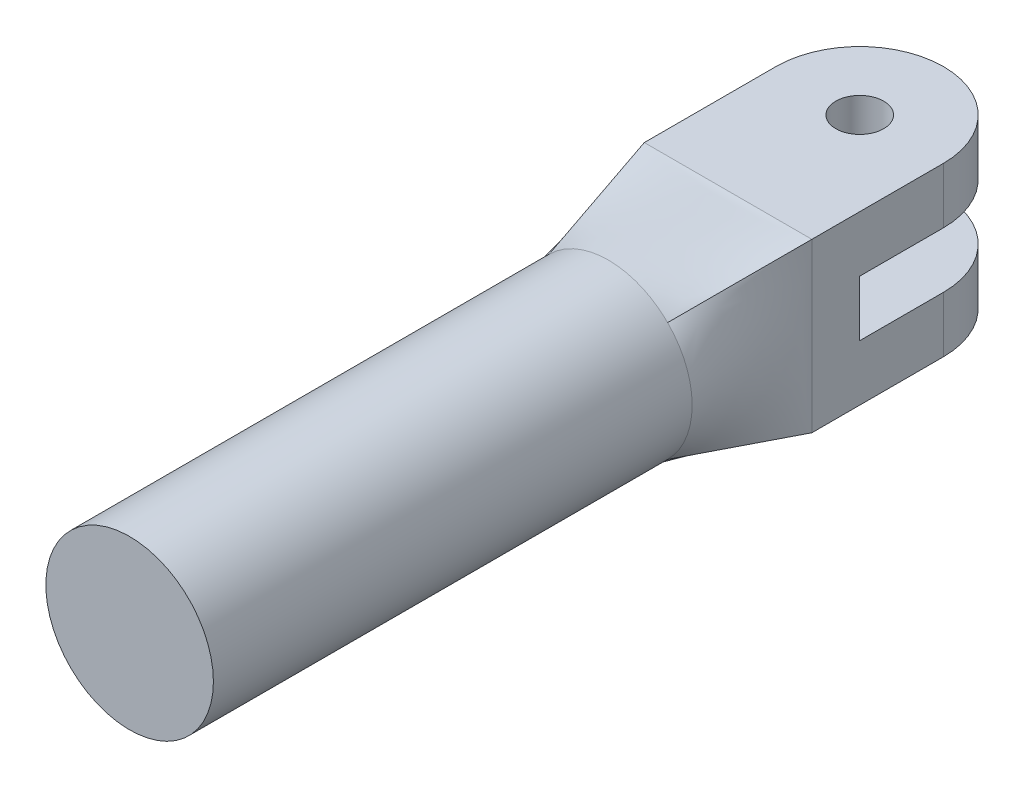
ISO-10303-21;
HEADER;
FILE_DESCRIPTION(('STEP AP214'),'2;1');
FILE_NAME('part.step','',(''),(''),'','','');
FILE_SCHEMA(('AUTOMOTIVE_DESIGN { 1 0 10303 214 1 1 1 1 }'));
ENDSEC;
DATA;
#1=APPLICATION_CONTEXT('core data for automotive mechanical design processes');
#2=APPLICATION_PROTOCOL_DEFINITION('international standard','automotive_design',2000,#1);
#3=PRODUCT_CONTEXT('',#1,'mechanical');
#4=PRODUCT('Part','Part','',(#3));
#5=PRODUCT_RELATED_PRODUCT_CATEGORY('part','',(#4));
#6=PRODUCT_DEFINITION_FORMATION('','',#4);
#7=PRODUCT_DEFINITION_CONTEXT('part definition',#1,'design');
#8=PRODUCT_DEFINITION('design','',#6,#7);
#9=PRODUCT_DEFINITION_SHAPE('','',#8);
#10=(LENGTH_UNIT() NAMED_UNIT(*) SI_UNIT(.MILLI.,.METRE.));
#11=(NAMED_UNIT(*) PLANE_ANGLE_UNIT() SI_UNIT($,.RADIAN.));
#12=(NAMED_UNIT(*) SI_UNIT($,.STERADIAN.) SOLID_ANGLE_UNIT());
#13=UNCERTAINTY_MEASURE_WITH_UNIT(LENGTH_MEASURE(1.E-05),#10,'distance_accuracy_value','');
#14=(GEOMETRIC_REPRESENTATION_CONTEXT(3) GLOBAL_UNCERTAINTY_ASSIGNED_CONTEXT((#13)) GLOBAL_UNIT_ASSIGNED_CONTEXT((#10,
#11,#12)) REPRESENTATION_CONTEXT('',''));
#15=CARTESIAN_POINT('',(0.,0.,0.));
#16=DIRECTION('',(0.,0.,1.));
#17=DIRECTION('',(1.,0.,0.));
#18=AXIS2_PLACEMENT_3D('',#15,#16,#17);
#19=CARTESIAN_POINT('',(0.,0.,-27.));
#20=DIRECTION('',(0.,0.,1.));
#21=DIRECTION('',(1.,0.,0.));
#22=AXIS2_PLACEMENT_3D('',#19,#20,#21);
#23=PLANE('',#22);
#24=DIRECTION('',(1.,0.,0.));
#25=VECTOR('',#24,1.);
#26=CARTESIAN_POINT('',(3.5,-1.16666666666667,-27.));
#27=LINE('',#26,#25);
#28=CARTESIAN_POINT('',(-3.5,-1.16666666666667,-27.));
#29=VERTEX_POINT('',#28);
#30=CARTESIAN_POINT('',(3.5,-1.16666666666667,-27.));
#31=VERTEX_POINT('',#30);
#32=EDGE_CURVE('E185',#29,#31,#27,.T.);
#33=ORIENTED_EDGE('',*,*,#32,.F.);
#34=DIRECTION('',(0.,1.,0.));
#35=VECTOR('',#34,1.);
#36=CARTESIAN_POINT('',(-3.5,-3.5,-27.));
#37=LINE('',#36,#35);
#38=CARTESIAN_POINT('',(-3.5,1.16666666666667,-27.));
#39=VERTEX_POINT('',#38);
#40=EDGE_CURVE('E170',#29,#39,#37,.T.);
#41=ORIENTED_EDGE('',*,*,#40,.T.);
#42=DIRECTION('',(-1.,0.,0.));
#43=VECTOR('',#42,1.);
#44=CARTESIAN_POINT('',(3.5,1.16666666666667,-27.));
#45=LINE('',#44,#43);
#46=CARTESIAN_POINT('',(3.5,1.16666666666667,-27.));
#47=VERTEX_POINT('',#46);
#48=EDGE_CURVE('E177',#47,#39,#45,.T.);
#49=ORIENTED_EDGE('',*,*,#48,.F.);
#50=DIRECTION('',(0.,-1.,0.));
#51=VECTOR('',#50,1.);
#52=CARTESIAN_POINT('',(3.5,-3.5,-27.));
#53=LINE('',#52,#51);
#54=EDGE_CURVE('E187',#47,#31,#53,.T.);
#55=ORIENTED_EDGE('',*,*,#54,.T.);
#56=EDGE_LOOP('',(#33,#41,#49,#55));
#57=FACE_BOUND('',#56,.T.);
#58=ADVANCED_FACE('F75',(#57),#23,.F.);
#59=CARTESIAN_POINT('',(0.,0.,-20.));
#60=DIRECTION('',(0.,0.,1.));
#61=DIRECTION('',(1.,0.,0.));
#62=AXIS2_PLACEMENT_3D('',#59,#60,#61);
#63=CYLINDRICAL_SURFACE('',#62,3.5);
#64=CARTESIAN_POINT('',(-2.47487373415292,2.47487373415292,-20.));
#65=CARTESIAN_POINT('',(-2.18320706748625,2.76654040081958,-20.));
#66=CARTESIAN_POINT('',(-1.81537804850474,3.0280550867366,-20.));
#67=CARTESIAN_POINT('',(-0.96486338398876,3.3961380592582,-20.));
#68=CARTESIAN_POINT('',(-0.483249156101944,3.5,-20.));
#69=CARTESIAN_POINT('',(0.483249156101944,3.5,-20.));
#70=CARTESIAN_POINT('',(0.964863383988761,3.3961380592582,-20.));
#71=CARTESIAN_POINT('',(1.81537804850474,3.0280550867366,-20.));
#72=CARTESIAN_POINT('',(2.18320706748625,2.76654040081958,-20.));
#73=CARTESIAN_POINT('',(2.47487373415292,2.47487373415292,-20.));
#74=B_SPLINE_CURVE_WITH_KNOTS('',3,(#64,#65,#66,#67,#68,#69,#70,#71,#72,#73),.UNSPECIFIED.,.F.,
.F.,(4,2,2,2,4),(0.,0.25,0.5,0.75,1.),.UNSPECIFIED.);
#75=CARTESIAN_POINT('',(2.47487373415292,2.47487373415292,-20.));
#76=VERTEX_POINT('',#75);
#77=CARTESIAN_POINT('',(-2.47487373415292,2.47487373415292,-20.));
#78=VERTEX_POINT('',#77);
#79=EDGE_CURVE('E286',#76,#78,#74,.F.);
#80=ORIENTED_EDGE('',*,*,#79,.T.);
#81=CARTESIAN_POINT('',(0.,0.,-20.));
#82=DIRECTION('',(0.,0.,-1.));
#83=DIRECTION('',(1.,0.,0.));
#84=AXIS2_PLACEMENT_3D('',#81,#82,#83);
#85=CIRCLE('',#84,3.5);
#86=CARTESIAN_POINT('',(-2.47487373415292,-2.47487373415292,-20.));
#87=VERTEX_POINT('',#86);
#88=EDGE_CURVE('E269',#87,#78,#85,.T.);
#89=ORIENTED_EDGE('',*,*,#88,.F.);
#90=CARTESIAN_POINT('',(0.,0.,-20.));
#91=DIRECTION('',(0.,0.,-1.));
#92=DIRECTION('',(1.,0.,0.));
#93=AXIS2_PLACEMENT_3D('',#90,#91,#92);
#94=CIRCLE('',#93,3.5);
#95=CARTESIAN_POINT('',(2.47487373415292,-2.47487373415292,-20.));
#96=VERTEX_POINT('',#95);
#97=EDGE_CURVE('E261',#96,#87,#94,.T.);
#98=ORIENTED_EDGE('',*,*,#97,.F.);
#99=CARTESIAN_POINT('',(0.,0.,-20.));
#100=DIRECTION('',(0.,0.,1.));
#101=DIRECTION('',(1.,0.,0.));
#102=AXIS2_PLACEMENT_3D('',#99,#100,#101);
#103=CIRCLE('',#102,3.5);
#104=EDGE_CURVE('E266',#76,#96,#103,.F.);
#105=ORIENTED_EDGE('',*,*,#104,.F.);
#106=EDGE_LOOP('',(#80,#89,#98,#105));
#107=FACE_BOUND('',#106,.T.);
#108=CARTESIAN_POINT('',(0.,0.,0.));
#109=DIRECTION('',(0.,0.,1.));
#110=DIRECTION('',(1.,0.,0.));
#111=AXIS2_PLACEMENT_3D('',#108,#109,#110);
#112=CIRCLE('',#111,3.5);
#113=CARTESIAN_POINT('',(3.5,0.,0.));
#114=VERTEX_POINT('',#113);
#115=EDGE_CURVE('E305',#114,#114,#112,.T.);
#116=ORIENTED_EDGE('',*,*,#115,.F.);
#117=EDGE_LOOP('',(#116));
#118=FACE_BOUND('',#117,.T.);
#119=ADVANCED_FACE('F316',(#107,#118),#63,.T.);
#120=CARTESIAN_POINT('',(0.,0.,0.));
#121=DIRECTION('',(0.,0.,1.));
#122=DIRECTION('',(1.,0.,0.));
#123=AXIS2_PLACEMENT_3D('',#120,#121,#122);
#124=PLANE('',#123);
#125=ORIENTED_EDGE('',*,*,#115,.T.);
#126=EDGE_LOOP('',(#125));
#127=FACE_BOUND('',#126,.T.);
#128=ADVANCED_FACE('F337',(#127),#124,.T.);
#129=CARTESIAN_POINT('',(-3.5,3.5,-25.));
#130=CARTESIAN_POINT('',(-2.47487373415292,2.47487373415292,-20.));
#131=CARTESIAN_POINT('',(-3.5,2.91666666666667,-25.));
#132=CARTESIAN_POINT('',(-2.76654040081958,2.18320706748625,-20.));
#133=CARTESIAN_POINT('',(-3.5,2.33333333333333,-25.));
#134=CARTESIAN_POINT('',(-3.0280550867366,1.81537804850474,-20.));
#135=CARTESIAN_POINT('',(-3.5,1.16666666666666,-25.));
#136=CARTESIAN_POINT('',(-3.39613805925819,0.964863383988761,-20.));
#137=CARTESIAN_POINT('',(-3.5,0.583333333333331,-25.));
#138=CARTESIAN_POINT('',(-3.5,0.483249156101944,-20.));
#139=CARTESIAN_POINT('',(-3.5,-0.583333333333335,-25.));
#140=CARTESIAN_POINT('',(-3.5,-0.483249156101943,-20.));
#141=CARTESIAN_POINT('',(-3.5,-1.16666666666667,-25.));
#142=CARTESIAN_POINT('',(-3.3961380592582,-0.96486338398876,-20.));
#143=CARTESIAN_POINT('',(-3.5,-2.33333333333333,-25.));
#144=CARTESIAN_POINT('',(-3.0280550867366,-1.81537804850474,-20.));
#145=CARTESIAN_POINT('',(-3.5,-2.91666666666667,-25.));
#146=CARTESIAN_POINT('',(-2.76654040081958,-2.18320706748625,-20.));
#147=CARTESIAN_POINT('',(-3.5,-3.5,-25.));
#148=CARTESIAN_POINT('',(-2.47487373415292,-2.47487373415292,-20.));
#149=B_SPLINE_SURFACE_WITH_KNOTS('',3,1,((#129,#130),(#131,#132),(#133,#134),(#135,#136),(#137,
#138),(#139,#140),(#141,#142),(#143,#144),(#145,#146),(#147,#148)),.UNSPECIFIED.,.F.,.F.,.F.,(4,
2,2,2,4),(2,2),(0.,0.25,0.5,0.75,1.),(0.,1.),.UNSPECIFIED.);
#150=DIRECTION('',(0.,1.,0.));
#151=VECTOR('',#150,1.);
#152=CARTESIAN_POINT('',(-3.5,-3.5,-25.));
#153=LINE('',#152,#151);
#154=CARTESIAN_POINT('',(-3.5,-3.5,-25.));
#155=VERTEX_POINT('',#154);
#156=CARTESIAN_POINT('',(-3.5,3.5,-25.));
#157=VERTEX_POINT('',#156);
#158=EDGE_CURVE('E441',#155,#157,#153,.T.);
#159=DIRECTION('',(0.196914887553392,0.196914887553392,0.960442113882805));
#160=VECTOR('',#159,1.);
#161=CARTESIAN_POINT('',(-2.98743686707646,-2.98743686707646,-22.5));
#162=LINE('',#161,#160);
#163=EDGE_CURVE('E215',#155,#87,#162,.T.);
#164=DIRECTION('',(-0.196914887553392,0.196914887553392,-0.960442113882805));
#165=VECTOR('',#164,1.);
#166=CARTESIAN_POINT('',(-2.98743686707646,2.98743686707646,-22.5));
#167=LINE('',#166,#165);
#168=EDGE_CURVE('E274',#78,#157,#167,.T.);
#169=ORIENTED_EDGE('',*,*,#158,.F.);
#170=ORIENTED_EDGE('',*,*,#163,.T.);
#171=ORIENTED_EDGE('',*,*,#88,.T.);
#172=ORIENTED_EDGE('',*,*,#168,.T.);
#173=EDGE_LOOP('',(#169,#170,#171,#172));
#174=FACE_BOUND('',#173,.T.);
#175=ADVANCED_FACE('F230',(#174),#149,.T.);
#176=CARTESIAN_POINT('',(-3.5,-3.5,-25.));
#177=CARTESIAN_POINT('',(-2.47487373415292,-2.47487373415292,-20.));
#178=CARTESIAN_POINT('',(-2.91666666666667,-3.5,-25.));
#179=CARTESIAN_POINT('',(-2.18320706748625,-2.76654040081958,-20.));
#180=CARTESIAN_POINT('',(-2.33333333333333,-3.5,-25.));
#181=CARTESIAN_POINT('',(-1.81537804850474,-3.0280550867366,-20.));
#182=CARTESIAN_POINT('',(-1.16666666666666,-3.5,-25.));
#183=CARTESIAN_POINT('',(-0.964863383988761,-3.3961380592582,-20.));
#184=CARTESIAN_POINT('',(-0.583333333333331,-3.5,-25.));
#185=CARTESIAN_POINT('',(-0.483249156101945,-3.5,-20.));
#186=CARTESIAN_POINT('',(0.583333333333335,-3.5,-25.));
#187=CARTESIAN_POINT('',(0.483249156101943,-3.5,-20.));
#188=CARTESIAN_POINT('',(1.16666666666667,-3.5,-25.));
#189=CARTESIAN_POINT('',(0.96486338398876,-3.3961380592582,-20.));
#190=CARTESIAN_POINT('',(2.33333333333333,-3.5,-25.));
#191=CARTESIAN_POINT('',(1.81537804850473,-3.0280550867366,-20.));
#192=CARTESIAN_POINT('',(2.91666666666667,-3.5,-25.));
#193=CARTESIAN_POINT('',(2.18320706748625,-2.76654040081958,-20.));
#194=CARTESIAN_POINT('',(3.5,-3.5,-25.));
#195=CARTESIAN_POINT('',(2.47487373415292,-2.47487373415292,-20.));
#196=B_SPLINE_SURFACE_WITH_KNOTS('',3,1,((#176,#177),(#178,#179),(#180,#181),(#182,#183),(#184,
#185),(#186,#187),(#188,#189),(#190,#191),(#192,#193),(#194,#195)),.UNSPECIFIED.,.F.,.F.,.F.,(4,
2,2,2,4),(2,2),(0.,0.25,0.5,0.75,1.),(0.,1.),.UNSPECIFIED.);
#197=DIRECTION('',(-1.,0.,0.));
#198=VECTOR('',#197,1.);
#199=CARTESIAN_POINT('',(3.5,-3.5,-25.));
#200=LINE('',#199,#198);
#201=CARTESIAN_POINT('',(3.5,-3.5,-25.));
#202=VERTEX_POINT('',#201);
#203=EDGE_CURVE('E209',#202,#155,#200,.T.);
#204=DIRECTION('',(-0.196914887553392,0.196914887553392,0.960442113882805));
#205=VECTOR('',#204,1.);
#206=CARTESIAN_POINT('',(2.98743686707646,-2.98743686707646,-22.5));
#207=LINE('',#206,#205);
#208=EDGE_CURVE('E265',#202,#96,#207,.T.);
#209=ORIENTED_EDGE('',*,*,#203,.F.);
#210=ORIENTED_EDGE('',*,*,#208,.T.);
#211=ORIENTED_EDGE('',*,*,#97,.T.);
#212=ORIENTED_EDGE('',*,*,#163,.F.);
#213=EDGE_LOOP('',(#209,#210,#211,#212));
#214=FACE_BOUND('',#213,.T.);
#215=ADVANCED_FACE('F217',(#214),#196,.T.);
#216=CARTESIAN_POINT('',(3.5,3.5,-25.));
#217=CARTESIAN_POINT('',(2.47487373415292,2.47487373415292,-20.));
#218=CARTESIAN_POINT('',(2.91666666666667,3.5,-25.));
#219=CARTESIAN_POINT('',(2.18320706748625,2.76654040081958,-20.));
#220=CARTESIAN_POINT('',(2.33333333333333,3.5,-25.));
#221=CARTESIAN_POINT('',(1.81537804850474,3.0280550867366,-20.));
#222=CARTESIAN_POINT('',(1.16666666666666,3.5,-25.));
#223=CARTESIAN_POINT('',(0.964863383988761,3.3961380592582,-20.));
#224=CARTESIAN_POINT('',(0.583333333333331,3.5,-25.));
#225=CARTESIAN_POINT('',(0.483249156101944,3.5,-20.));
#226=CARTESIAN_POINT('',(-0.583333333333335,3.5,-25.));
#227=CARTESIAN_POINT('',(-0.483249156101944,3.5,-20.));
#228=CARTESIAN_POINT('',(-1.16666666666667,3.5,-25.));
#229=CARTESIAN_POINT('',(-0.96486338398876,3.3961380592582,-20.));
#230=CARTESIAN_POINT('',(-2.33333333333333,3.5,-25.));
#231=CARTESIAN_POINT('',(-1.81537804850474,3.0280550867366,-20.));
#232=CARTESIAN_POINT('',(-2.91666666666667,3.5,-25.));
#233=CARTESIAN_POINT('',(-2.18320706748625,2.76654040081958,-20.));
#234=CARTESIAN_POINT('',(-3.5,3.5,-25.));
#235=CARTESIAN_POINT('',(-2.47487373415292,2.47487373415292,-20.));
#236=B_SPLINE_SURFACE_WITH_KNOTS('',3,1,((#216,#217),(#218,#219),(#220,#221),(#222,#223),(#224,
#225),(#226,#227),(#228,#229),(#230,#231),(#232,#233),(#234,#235)),.UNSPECIFIED.,.F.,.F.,.F.,(4,
2,2,2,4),(2,2),(0.,0.25,0.5,0.75,1.),(0.,1.),.UNSPECIFIED.);
#237=DIRECTION('',(1.,0.,0.));
#238=VECTOR('',#237,1.);
#239=CARTESIAN_POINT('',(3.5,3.5,-25.));
#240=LINE('',#239,#238);
#241=CARTESIAN_POINT('',(3.5,3.5,-25.));
#242=VERTEX_POINT('',#241);
#243=EDGE_CURVE('E456',#157,#242,#240,.T.);
#244=DIRECTION('',(-0.196914887553392,-0.196914887553392,0.960442113882805));
#245=VECTOR('',#244,1.);
#246=CARTESIAN_POINT('',(2.98743686707646,2.98743686707646,-22.5));
#247=LINE('',#246,#245);
#248=EDGE_CURVE('E296',#242,#76,#247,.T.);
#249=ORIENTED_EDGE('',*,*,#243,.F.);
#250=ORIENTED_EDGE('',*,*,#168,.F.);
#251=ORIENTED_EDGE('',*,*,#79,.F.);
#252=ORIENTED_EDGE('',*,*,#248,.F.);
#253=EDGE_LOOP('',(#249,#250,#251,#252));
#254=FACE_BOUND('',#253,.T.);
#255=ADVANCED_FACE('F229',(#254),#236,.T.);
#256=CARTESIAN_POINT('',(3.5,-3.5,-25.));
#257=CARTESIAN_POINT('',(2.47487373415292,-2.47487373415292,-20.));
#258=CARTESIAN_POINT('',(3.5,-2.91666666666667,-25.));
#259=CARTESIAN_POINT('',(2.76654040081958,-2.18320706748625,-20.));
#260=CARTESIAN_POINT('',(3.5,-2.33333333333333,-25.));
#261=CARTESIAN_POINT('',(3.0280550867366,-1.81537804850474,-20.));
#262=CARTESIAN_POINT('',(3.5,-1.16666666666666,-25.));
#263=CARTESIAN_POINT('',(3.3961380592582,-0.964863383988761,-20.));
#264=CARTESIAN_POINT('',(3.5,-0.583333333333331,-25.));
#265=CARTESIAN_POINT('',(3.5,-0.483249156101945,-20.));
#266=CARTESIAN_POINT('',(3.5,0.583333333333335,-25.));
#267=CARTESIAN_POINT('',(3.5,0.483249156101944,-20.));
#268=CARTESIAN_POINT('',(3.5,1.16666666666667,-25.));
#269=CARTESIAN_POINT('',(3.3961380592582,0.964863383988761,-20.));
#270=CARTESIAN_POINT('',(3.5,2.33333333333333,-25.));
#271=CARTESIAN_POINT('',(3.0280550867366,1.81537804850474,-20.));
#272=CARTESIAN_POINT('',(3.5,2.91666666666667,-25.));
#273=CARTESIAN_POINT('',(2.76654040081958,2.18320706748625,-20.));
#274=CARTESIAN_POINT('',(3.5,3.5,-25.));
#275=CARTESIAN_POINT('',(2.47487373415292,2.47487373415292,-20.));
#276=B_SPLINE_SURFACE_WITH_KNOTS('',3,1,((#256,#257),(#258,#259),(#260,#261),(#262,#263),(#264,
#265),(#266,#267),(#268,#269),(#270,#271),(#272,#273),(#274,#275)),.UNSPECIFIED.,.F.,.F.,.F.,(4,
2,2,2,4),(2,2),(0.,0.25,0.5,0.75,1.),(0.,1.),.UNSPECIFIED.);
#277=DIRECTION('',(0.,-1.,0.));
#278=VECTOR('',#277,1.);
#279=CARTESIAN_POINT('',(3.5,-3.5,-25.));
#280=LINE('',#279,#278);
#281=EDGE_CURVE('E311',#242,#202,#280,.T.);
#282=ORIENTED_EDGE('',*,*,#281,.F.);
#283=ORIENTED_EDGE('',*,*,#248,.T.);
#284=ORIENTED_EDGE('',*,*,#104,.T.);
#285=ORIENTED_EDGE('',*,*,#208,.F.);
#286=EDGE_LOOP('',(#282,#283,#284,#285));
#287=FACE_BOUND('',#286,.T.);
#288=ADVANCED_FACE('F308',(#287),#276,.T.);
#289=CARTESIAN_POINT('',(-3.5,-3.5,-27.));
#290=DIRECTION('',(1.,0.,0.));
#291=DIRECTION('',(0.,0.,-1.));
#292=AXIS2_PLACEMENT_3D('',#289,#290,#291);
#293=PLANE('',#292);
#294=DIRECTION('',(0.,0.,1.));
#295=VECTOR('',#294,1.);
#296=CARTESIAN_POINT('',(-3.5,3.5,-27.));
#297=LINE('',#296,#295);
#298=CARTESIAN_POINT('',(-3.5,3.5,-30.5));
#299=VERTEX_POINT('',#298);
#300=EDGE_CURVE('E447',#299,#157,#297,.T.);
#301=ORIENTED_EDGE('',*,*,#300,.F.);
#302=DIRECTION('',(0.,1.,0.));
#303=VECTOR('',#302,1.);
#304=CARTESIAN_POINT('',(-3.5,1.16666666666667,-30.5));
#305=LINE('',#304,#303);
#306=CARTESIAN_POINT('',(-3.5,1.16666666666667,-30.5));
#307=VERTEX_POINT('',#306);
#308=EDGE_CURVE('E172',#299,#307,#305,.F.);
#309=ORIENTED_EDGE('',*,*,#308,.T.);
#310=DIRECTION('',(0.,0.,1.));
#311=VECTOR('',#310,1.);
#312=CARTESIAN_POINT('',(-3.5,1.16666666666667,-34.));
#313=LINE('',#312,#311);
#314=EDGE_CURVE('E165',#307,#39,#313,.T.);
#315=ORIENTED_EDGE('',*,*,#314,.T.);
#316=ORIENTED_EDGE('',*,*,#40,.F.);
#317=DIRECTION('',(0.,0.,1.));
#318=VECTOR('',#317,1.);
#319=CARTESIAN_POINT('',(-3.5,-1.16666666666667,-34.));
#320=LINE('',#319,#318);
#321=CARTESIAN_POINT('',(-3.5,-1.16666666666667,-30.5));
#322=VERTEX_POINT('',#321);
#323=EDGE_CURVE('E421',#322,#29,#320,.T.);
#324=ORIENTED_EDGE('',*,*,#323,.F.);
#325=DIRECTION('',(0.,1.,0.));
#326=VECTOR('',#325,1.);
#327=CARTESIAN_POINT('',(-3.5,-3.5,-30.5));
#328=LINE('',#327,#326);
#329=CARTESIAN_POINT('',(-3.5,-3.5,-30.5));
#330=VERTEX_POINT('',#329);
#331=EDGE_CURVE('E545',#322,#330,#328,.F.);
#332=ORIENTED_EDGE('',*,*,#331,.T.);
#333=DIRECTION('',(0.,0.,1.));
#334=VECTOR('',#333,1.);
#335=CARTESIAN_POINT('',(-3.5,-3.5,-27.));
#336=LINE('',#335,#334);
#337=EDGE_CURVE('E202',#330,#155,#336,.T.);
#338=ORIENTED_EDGE('',*,*,#337,.T.);
#339=ORIENTED_EDGE('',*,*,#158,.T.);
#340=EDGE_LOOP('',(#301,#309,#315,#316,#324,#332,#338,#339));
#341=FACE_BOUND('',#340,.T.);
#342=ADVANCED_FACE('F168',(#341),#293,.F.);
#343=CARTESIAN_POINT('',(3.5,3.5,-27.));
#344=DIRECTION('',(0.,-1.,0.));
#345=DIRECTION('',(0.,0.,-1.));
#346=AXIS2_PLACEMENT_3D('',#343,#344,#345);
#347=PLANE('',#346);
#348=CARTESIAN_POINT('',(0.,3.5,-30.5));
#349=DIRECTION('',(0.,1.,0.));
#350=DIRECTION('',(0.,0.,1.));
#351=AXIS2_PLACEMENT_3D('',#348,#349,#350);
#352=CIRCLE('',#351,1.);
#353=CARTESIAN_POINT('',(0.,3.5,-29.5));
#354=VERTEX_POINT('',#353);
#355=EDGE_CURVE('E400',#354,#354,#352,.T.);
#356=ORIENTED_EDGE('',*,*,#355,.F.);
#357=EDGE_LOOP('',(#356));
#358=FACE_BOUND('',#357,.T.);
#359=CARTESIAN_POINT('',(0.,3.5,-30.5));
#360=DIRECTION('',(0.,-1.,0.));
#361=DIRECTION('',(0.,0.,-1.));
#362=AXIS2_PLACEMENT_3D('',#359,#360,#361);
#363=CIRCLE('',#362,3.5);
#364=CARTESIAN_POINT('',(3.5,3.5,-30.5));
#365=VERTEX_POINT('',#364);
#366=CARTESIAN_POINT('',(0.,3.5,-34.));
#367=VERTEX_POINT('',#366);
#368=EDGE_CURVE('E304',#365,#367,#363,.F.);
#369=ORIENTED_EDGE('',*,*,#368,.T.);
#370=CARTESIAN_POINT('',(0.,3.5,-30.5));
#371=DIRECTION('',(0.,-1.,0.));
#372=DIRECTION('',(0.,0.,-1.));
#373=AXIS2_PLACEMENT_3D('',#370,#371,#372);
#374=CIRCLE('',#373,3.5);
#375=EDGE_CURVE('E489',#367,#299,#374,.F.);
#376=ORIENTED_EDGE('',*,*,#375,.T.);
#377=ORIENTED_EDGE('',*,*,#300,.T.);
#378=ORIENTED_EDGE('',*,*,#243,.T.);
#379=DIRECTION('',(0.,0.,1.));
#380=VECTOR('',#379,1.);
#381=CARTESIAN_POINT('',(3.5,3.5,-27.));
#382=LINE('',#381,#380);
#383=EDGE_CURVE('E389',#365,#242,#382,.T.);
#384=ORIENTED_EDGE('',*,*,#383,.F.);
#385=EDGE_LOOP('',(#369,#376,#377,#378,#384));
#386=FACE_BOUND('',#385,.T.);
#387=ADVANCED_FACE('F461',(#358,#386),#347,.F.);
#388=CARTESIAN_POINT('',(3.5,-3.5,-27.));
#389=DIRECTION('',(-1.,0.,0.));
#390=DIRECTION('',(0.,0.,1.));
#391=AXIS2_PLACEMENT_3D('',#388,#389,#390);
#392=PLANE('',#391);
#393=DIRECTION('',(0.,0.,1.));
#394=VECTOR('',#393,1.);
#395=CARTESIAN_POINT('',(3.5,-3.5,-27.));
#396=LINE('',#395,#394);
#397=CARTESIAN_POINT('',(3.5,-3.5,-30.5));
#398=VERTEX_POINT('',#397);
#399=EDGE_CURVE('E385',#398,#202,#396,.T.);
#400=ORIENTED_EDGE('',*,*,#399,.F.);
#401=DIRECTION('',(0.,-1.,0.));
#402=VECTOR('',#401,1.);
#403=CARTESIAN_POINT('',(3.5,-3.5,-30.5));
#404=LINE('',#403,#402);
#405=CARTESIAN_POINT('',(3.5,-1.16666666666667,-30.5));
#406=VERTEX_POINT('',#405);
#407=EDGE_CURVE('E12',#398,#406,#404,.F.);
#408=ORIENTED_EDGE('',*,*,#407,.T.);
#409=DIRECTION('',(0.,0.,1.));
#410=VECTOR('',#409,1.);
#411=CARTESIAN_POINT('',(3.5,-1.16666666666667,-34.));
#412=LINE('',#411,#410);
#413=EDGE_CURVE('E194',#406,#31,#412,.T.);
#414=ORIENTED_EDGE('',*,*,#413,.T.);
#415=ORIENTED_EDGE('',*,*,#54,.F.);
#416=DIRECTION('',(0.,0.,1.));
#417=VECTOR('',#416,1.);
#418=CARTESIAN_POINT('',(3.5,1.16666666666667,-34.));
#419=LINE('',#418,#417);
#420=CARTESIAN_POINT('',(3.5,1.16666666666667,-30.5));
#421=VERTEX_POINT('',#420);
#422=EDGE_CURVE('E176',#421,#47,#419,.T.);
#423=ORIENTED_EDGE('',*,*,#422,.F.);
#424=DIRECTION('',(0.,-1.,0.));
#425=VECTOR('',#424,1.);
#426=CARTESIAN_POINT('',(3.5,3.5,-30.5));
#427=LINE('',#426,#425);
#428=EDGE_CURVE('E85',#421,#365,#427,.F.);
#429=ORIENTED_EDGE('',*,*,#428,.T.);
#430=ORIENTED_EDGE('',*,*,#383,.T.);
#431=ORIENTED_EDGE('',*,*,#281,.T.);
#432=EDGE_LOOP('',(#400,#408,#414,#415,#423,#429,#430,#431));
#433=FACE_BOUND('',#432,.T.);
#434=ADVANCED_FACE('F366',(#433),#392,.F.);
#435=CARTESIAN_POINT('',(3.5,-3.5,-27.));
#436=DIRECTION('',(0.,1.,0.));
#437=DIRECTION('',(0.,0.,1.));
#438=AXIS2_PLACEMENT_3D('',#435,#436,#437);
#439=PLANE('',#438);
#440=CARTESIAN_POINT('',(0.,-3.5,-30.5));
#441=DIRECTION('',(0.,1.,0.));
#442=DIRECTION('',(0.,0.,1.));
#443=AXIS2_PLACEMENT_3D('',#440,#441,#442);
#444=CIRCLE('',#443,1.);
#445=CARTESIAN_POINT('',(0.,-3.5,-29.5));
#446=VERTEX_POINT('',#445);
#447=EDGE_CURVE('E423',#446,#446,#444,.T.);
#448=ORIENTED_EDGE('',*,*,#447,.T.);
#449=EDGE_LOOP('',(#448));
#450=FACE_BOUND('',#449,.T.);
#451=ORIENTED_EDGE('',*,*,#337,.F.);
#452=CARTESIAN_POINT('',(0.,-3.5,-30.5));
#453=DIRECTION('',(0.,1.,0.));
#454=DIRECTION('',(0.,0.,1.));
#455=AXIS2_PLACEMENT_3D('',#452,#453,#454);
#456=CIRCLE('',#455,3.5);
#457=CARTESIAN_POINT('',(0.,-3.5,-34.));
#458=VERTEX_POINT('',#457);
#459=EDGE_CURVE('E98',#330,#458,#456,.F.);
#460=ORIENTED_EDGE('',*,*,#459,.T.);
#461=CARTESIAN_POINT('',(0.,-3.5,-30.5));
#462=DIRECTION('',(0.,1.,0.));
#463=DIRECTION('',(0.,0.,1.));
#464=AXIS2_PLACEMENT_3D('',#461,#462,#463);
#465=CIRCLE('',#464,3.5);
#466=EDGE_CURVE('E93',#458,#398,#465,.F.);
#467=ORIENTED_EDGE('',*,*,#466,.T.);
#468=ORIENTED_EDGE('',*,*,#399,.T.);
#469=ORIENTED_EDGE('',*,*,#203,.T.);
#470=EDGE_LOOP('',(#451,#460,#467,#468,#469));
#471=FACE_BOUND('',#470,.T.);
#472=ADVANCED_FACE('F362',(#450,#471),#439,.F.);
#473=CARTESIAN_POINT('',(3.5,1.16666666666667,-34.));
#474=DIRECTION('',(0.,1.,0.));
#475=DIRECTION('',(-1.,0.,0.));
#476=AXIS2_PLACEMENT_3D('',#473,#474,#475);
#477=PLANE('',#476);
#478=CARTESIAN_POINT('',(0.,1.16666666666667,-30.5));
#479=DIRECTION('',(0.,1.,0.));
#480=DIRECTION('',(-1.,0.,0.));
#481=AXIS2_PLACEMENT_3D('',#478,#479,#480);
#482=CIRCLE('',#481,1.);
#483=CARTESIAN_POINT('',(0.,1.16666666666667,-29.5));
#484=VERTEX_POINT('',#483);
#485=EDGE_CURVE('E429',#484,#484,#482,.T.);
#486=ORIENTED_EDGE('',*,*,#485,.T.);
#487=EDGE_LOOP('',(#486));
#488=FACE_BOUND('',#487,.T.);
#489=ORIENTED_EDGE('',*,*,#314,.F.);
#490=CARTESIAN_POINT('',(0.,1.16666666666667,-30.5));
#491=DIRECTION('',(0.,1.,0.));
#492=DIRECTION('',(-1.,0.,0.));
#493=AXIS2_PLACEMENT_3D('',#490,#491,#492);
#494=CIRCLE('',#493,3.5);
#495=CARTESIAN_POINT('',(0.,1.16666666666667,-34.));
#496=VERTEX_POINT('',#495);
#497=EDGE_CURVE('E553',#307,#496,#494,.F.);
#498=ORIENTED_EDGE('',*,*,#497,.T.);
#499=CARTESIAN_POINT('',(0.,1.16666666666667,-30.5));
#500=DIRECTION('',(0.,1.,0.));
#501=DIRECTION('',(-1.,0.,0.));
#502=AXIS2_PLACEMENT_3D('',#499,#500,#501);
#503=CIRCLE('',#502,3.5);
#504=EDGE_CURVE('E550',#496,#421,#503,.F.);
#505=ORIENTED_EDGE('',*,*,#504,.T.);
#506=ORIENTED_EDGE('',*,*,#422,.T.);
#507=ORIENTED_EDGE('',*,*,#48,.T.);
#508=EDGE_LOOP('',(#489,#498,#505,#506,#507));
#509=FACE_BOUND('',#508,.T.);
#510=ADVANCED_FACE('F189',(#488,#509),#477,.F.);
#511=CARTESIAN_POINT('',(3.5,-1.16666666666667,-34.));
#512=DIRECTION('',(0.,-1.,0.));
#513=DIRECTION('',(1.,0.,0.));
#514=AXIS2_PLACEMENT_3D('',#511,#512,#513);
#515=PLANE('',#514);
#516=CARTESIAN_POINT('',(0.,-1.16666666666667,-30.5));
#517=DIRECTION('',(0.,-1.,0.));
#518=DIRECTION('',(1.,0.,0.));
#519=AXIS2_PLACEMENT_3D('',#516,#517,#518);
#520=CIRCLE('',#519,1.);
#521=CARTESIAN_POINT('',(0.,-1.16666666666667,-29.5));
#522=VERTEX_POINT('',#521);
#523=EDGE_CURVE('E406',#522,#522,#520,.T.);
#524=ORIENTED_EDGE('',*,*,#523,.T.);
#525=EDGE_LOOP('',(#524));
#526=FACE_BOUND('',#525,.T.);
#527=CARTESIAN_POINT('',(0.,-1.16666666666667,-30.5));
#528=DIRECTION('',(0.,-1.,0.));
#529=DIRECTION('',(1.,0.,0.));
#530=AXIS2_PLACEMENT_3D('',#527,#528,#529);
#531=CIRCLE('',#530,3.5);
#532=CARTESIAN_POINT('',(0.,-1.16666666666667,-34.));
#533=VERTEX_POINT('',#532);
#534=EDGE_CURVE('E415',#406,#533,#531,.F.);
#535=ORIENTED_EDGE('',*,*,#534,.T.);
#536=CARTESIAN_POINT('',(0.,-1.16666666666667,-30.5));
#537=DIRECTION('',(0.,-1.,0.));
#538=DIRECTION('',(1.,0.,0.));
#539=AXIS2_PLACEMENT_3D('',#536,#537,#538);
#540=CIRCLE('',#539,3.5);
#541=EDGE_CURVE('E390',#533,#322,#540,.F.);
#542=ORIENTED_EDGE('',*,*,#541,.T.);
#543=ORIENTED_EDGE('',*,*,#323,.T.);
#544=ORIENTED_EDGE('',*,*,#32,.T.);
#545=ORIENTED_EDGE('',*,*,#413,.F.);
#546=EDGE_LOOP('',(#535,#542,#543,#544,#545));
#547=FACE_BOUND('',#546,.T.);
#548=ADVANCED_FACE('F419',(#526,#547),#515,.F.);
#549=CARTESIAN_POINT('',(0.,-3.51,-30.5));
#550=DIRECTION('',(0.,1.,0.));
#551=DIRECTION('',(0.,0.,1.));
#552=AXIS2_PLACEMENT_3D('',#549,#550,#551);
#553=CYLINDRICAL_SURFACE('',#552,1.);
#554=CARTESIAN_POINT('',(0.,-1.16666666666667,-29.5));
#555=CARTESIAN_POINT('',(0.,-1.19097222222222,-29.5));
#556=CARTESIAN_POINT('',(0.,-1.21527777777778,-29.5));
#557=CARTESIAN_POINT('',(0.,-1.26388888888889,-29.5));
#558=CARTESIAN_POINT('',(0.,-1.28819444444444,-29.5));
#559=CARTESIAN_POINT('',(0.,-1.33680555555556,-29.5));
#560=CARTESIAN_POINT('',(0.,-1.36111111111111,-29.5));
#561=CARTESIAN_POINT('',(0.,-1.40972222222222,-29.5));
#562=CARTESIAN_POINT('',(0.,-1.43402777777778,-29.5));
#563=CARTESIAN_POINT('',(0.,-1.48263888888889,-29.5));
#564=CARTESIAN_POINT('',(0.,-1.50694444444444,-29.5));
#565=CARTESIAN_POINT('',(0.,-1.55555555555556,-29.5));
#566=CARTESIAN_POINT('',(0.,-1.57986111111111,-29.5));
#567=CARTESIAN_POINT('',(0.,-1.62847222222222,-29.5));
#568=CARTESIAN_POINT('',(0.,-1.65277777777778,-29.5));
#569=CARTESIAN_POINT('',(0.,-1.70138888888889,-29.5));
#570=CARTESIAN_POINT('',(0.,-1.72569444444444,-29.5));
#571=CARTESIAN_POINT('',(0.,-1.77430555555556,-29.5));
#572=CARTESIAN_POINT('',(0.,-1.79861111111111,-29.5));
#573=CARTESIAN_POINT('',(0.,-1.84722222222222,-29.5));
#574=CARTESIAN_POINT('',(0.,-1.87152777777778,-29.5));
#575=CARTESIAN_POINT('',(0.,-1.92013888888889,-29.5));
#576=CARTESIAN_POINT('',(0.,-1.94444444444444,-29.5));
#577=CARTESIAN_POINT('',(0.,-1.99305555555556,-29.5));
#578=CARTESIAN_POINT('',(0.,-2.01736111111111,-29.5));
#579=CARTESIAN_POINT('',(0.,-2.06597222222222,-29.5));
#580=CARTESIAN_POINT('',(0.,-2.09027777777778,-29.5));
#581=CARTESIAN_POINT('',(0.,-2.13888888888889,-29.5));
#582=CARTESIAN_POINT('',(0.,-2.16319444444444,-29.5));
#583=CARTESIAN_POINT('',(0.,-2.21180555555556,-29.5));
#584=CARTESIAN_POINT('',(0.,-2.23611111111111,-29.5));
#585=CARTESIAN_POINT('',(0.,-2.28472222222222,-29.5));
#586=CARTESIAN_POINT('',(0.,-2.30902777777778,-29.5));
#587=CARTESIAN_POINT('',(0.,-2.35763888888889,-29.5));
#588=CARTESIAN_POINT('',(0.,-2.38194444444444,-29.5));
#589=CARTESIAN_POINT('',(0.,-2.43055555555556,-29.5));
#590=CARTESIAN_POINT('',(0.,-2.45486111111111,-29.5));
#591=CARTESIAN_POINT('',(0.,-2.50347222222222,-29.5));
#592=CARTESIAN_POINT('',(0.,-2.52777777777778,-29.5));
#593=CARTESIAN_POINT('',(0.,-2.57638888888889,-29.5));
#594=CARTESIAN_POINT('',(0.,-2.60069444444444,-29.5));
#595=CARTESIAN_POINT('',(0.,-2.64930555555556,-29.5));
#596=CARTESIAN_POINT('',(0.,-2.67361111111111,-29.5));
#597=CARTESIAN_POINT('',(0.,-2.72222222222222,-29.5));
#598=CARTESIAN_POINT('',(0.,-2.74652777777778,-29.5));
#599=CARTESIAN_POINT('',(0.,-2.79513888888889,-29.5));
#600=CARTESIAN_POINT('',(0.,-2.81944444444444,-29.5));
#601=CARTESIAN_POINT('',(0.,-2.86805555555556,-29.5));
#602=CARTESIAN_POINT('',(0.,-2.89236111111111,-29.5));
#603=CARTESIAN_POINT('',(0.,-2.94097222222222,-29.5));
#604=CARTESIAN_POINT('',(0.,-2.96527777777778,-29.5));
#605=CARTESIAN_POINT('',(0.,-3.01388888888889,-29.5));
#606=CARTESIAN_POINT('',(0.,-3.03819444444444,-29.5));
#607=CARTESIAN_POINT('',(0.,-3.08680555555556,-29.5));
#608=CARTESIAN_POINT('',(0.,-3.11111111111111,-29.5));
#609=CARTESIAN_POINT('',(0.,-3.15972222222222,-29.5));
#610=CARTESIAN_POINT('',(0.,-3.18402777777778,-29.5));
#611=CARTESIAN_POINT('',(0.,-3.23263888888889,-29.5));
#612=CARTESIAN_POINT('',(0.,-3.25694444444444,-29.5));
#613=CARTESIAN_POINT('',(0.,-3.30555555555556,-29.5));
#614=CARTESIAN_POINT('',(0.,-3.32986111111111,-29.5));
#615=CARTESIAN_POINT('',(0.,-3.37847222222222,-29.5));
#616=CARTESIAN_POINT('',(0.,-3.40277777777778,-29.5));
#617=CARTESIAN_POINT('',(0.,-3.45138888888889,-29.5));
#618=CARTESIAN_POINT('',(0.,-3.47569444444444,-29.5));
#619=CARTESIAN_POINT('',(0.,-3.5,-29.5));
#620=B_SPLINE_CURVE_WITH_KNOTS('',3,(#554,#555,#556,#557,#558,#559,#560,#561,#562,#563,#564,
#565,#566,#567,#568,#569,#570,#571,#572,#573,#574,#575,#576,#577,#578,#579,#580,#581,#582,#583,
#584,#585,#586,#587,#588,#589,#590,#591,#592,#593,#594,#595,#596,#597,#598,#599,#600,#601,#602,
#603,#604,#605,#606,#607,#608,#609,#610,#611,#612,#613,#614,#615,#616,#617,#618,#619),
.UNSPECIFIED.,.F.,.F.,(4,2,2,2,2,2,2,2,2,2,2,2,2,2,2,2,2,2,2,2,2,2,2,2,2,2,2,2,2,2,2,2,4),(0.,
0.0729166666666669,0.145833333333333,0.21875,0.291666666666667,0.364583333333334,0.4375,
0.510416666666667,0.583333333333333,0.65625,0.729166666666667,0.802083333333333,0.875,
0.947916666666666,1.02083333333333,1.09375,1.16666666666667,1.23958333333333,1.3125,
1.38541666666667,1.45833333333333,1.53125,1.60416666666667,1.67708333333333,1.75,
1.82291666666667,1.89583333333333,1.96875,2.04166666666667,2.11458333333333,2.1875,
2.26041666666667,2.33333333333333),.UNSPECIFIED.);
#621=EDGE_CURVE('BSEAM647',#522,#446,#620,.T.);
#622=ORIENTED_EDGE('',*,*,#523,.F.);
#623=ORIENTED_EDGE('',*,*,#447,.F.);
#624=ORIENTED_EDGE('',*,*,#621,.T.);
#625=ORIENTED_EDGE('',*,*,#621,.F.);
#626=EDGE_LOOP('',(#622,#624,#623,#625));
#627=FACE_BOUND('',#626,.T.);
#628=ADVANCED_FACE('F647',(#627),#553,.F.);
#629=CARTESIAN_POINT('',(0.,3.5,-29.5));
#630=CARTESIAN_POINT('',(0.,3.47569444444444,-29.5));
#631=CARTESIAN_POINT('',(0.,3.45138888888889,-29.5));
#632=CARTESIAN_POINT('',(0.,3.40277777777778,-29.5));
#633=CARTESIAN_POINT('',(0.,3.37847222222222,-29.5));
#634=CARTESIAN_POINT('',(0.,3.32986111111111,-29.5));
#635=CARTESIAN_POINT('',(0.,3.30555555555555,-29.5));
#636=CARTESIAN_POINT('',(0.,3.25694444444444,-29.5));
#637=CARTESIAN_POINT('',(0.,3.23263888888889,-29.5));
#638=CARTESIAN_POINT('',(0.,3.18402777777778,-29.5));
#639=CARTESIAN_POINT('',(0.,3.15972222222222,-29.5));
#640=CARTESIAN_POINT('',(0.,3.11111111111111,-29.5));
#641=CARTESIAN_POINT('',(0.,3.08680555555555,-29.5));
#642=CARTESIAN_POINT('',(0.,3.03819444444444,-29.5));
#643=CARTESIAN_POINT('',(0.,3.01388888888889,-29.5));
#644=CARTESIAN_POINT('',(0.,2.96527777777778,-29.5));
#645=CARTESIAN_POINT('',(0.,2.94097222222222,-29.5));
#646=CARTESIAN_POINT('',(0.,2.89236111111111,-29.5));
#647=CARTESIAN_POINT('',(0.,2.86805555555555,-29.5));
#648=CARTESIAN_POINT('',(0.,2.81944444444444,-29.5));
#649=CARTESIAN_POINT('',(0.,2.79513888888889,-29.5));
#650=CARTESIAN_POINT('',(0.,2.74652777777778,-29.5));
#651=CARTESIAN_POINT('',(0.,2.72222222222222,-29.5));
#652=CARTESIAN_POINT('',(0.,2.67361111111111,-29.5));
#653=CARTESIAN_POINT('',(0.,2.64930555555555,-29.5));
#654=CARTESIAN_POINT('',(0.,2.60069444444444,-29.5));
#655=CARTESIAN_POINT('',(0.,2.57638888888889,-29.5));
#656=CARTESIAN_POINT('',(0.,2.52777777777778,-29.5));
#657=CARTESIAN_POINT('',(0.,2.50347222222222,-29.5));
#658=CARTESIAN_POINT('',(0.,2.45486111111111,-29.5));
#659=CARTESIAN_POINT('',(0.,2.43055555555555,-29.5));
#660=CARTESIAN_POINT('',(0.,2.38194444444444,-29.5));
#661=CARTESIAN_POINT('',(0.,2.35763888888889,-29.5));
#662=CARTESIAN_POINT('',(0.,2.30902777777778,-29.5));
#663=CARTESIAN_POINT('',(0.,2.28472222222222,-29.5));
#664=CARTESIAN_POINT('',(0.,2.23611111111111,-29.5));
#665=CARTESIAN_POINT('',(0.,2.21180555555556,-29.5));
#666=CARTESIAN_POINT('',(0.,2.16319444444444,-29.5));
#667=CARTESIAN_POINT('',(0.,2.13888888888889,-29.5));
#668=CARTESIAN_POINT('',(0.,2.09027777777778,-29.5));
#669=CARTESIAN_POINT('',(0.,2.06597222222222,-29.5));
#670=CARTESIAN_POINT('',(0.,2.01736111111111,-29.5));
#671=CARTESIAN_POINT('',(0.,1.99305555555556,-29.5));
#672=CARTESIAN_POINT('',(0.,1.94444444444444,-29.5));
#673=CARTESIAN_POINT('',(0.,1.92013888888889,-29.5));
#674=CARTESIAN_POINT('',(0.,1.87152777777778,-29.5));
#675=CARTESIAN_POINT('',(0.,1.84722222222222,-29.5));
#676=CARTESIAN_POINT('',(0.,1.79861111111111,-29.5));
#677=CARTESIAN_POINT('',(0.,1.77430555555555,-29.5));
#678=CARTESIAN_POINT('',(0.,1.72569444444444,-29.5));
#679=CARTESIAN_POINT('',(0.,1.70138888888889,-29.5));
#680=CARTESIAN_POINT('',(0.,1.65277777777778,-29.5));
#681=CARTESIAN_POINT('',(0.,1.62847222222222,-29.5));
#682=CARTESIAN_POINT('',(0.,1.57986111111111,-29.5));
#683=CARTESIAN_POINT('',(0.,1.55555555555556,-29.5));
#684=CARTESIAN_POINT('',(0.,1.50694444444444,-29.5));
#685=CARTESIAN_POINT('',(0.,1.48263888888889,-29.5));
#686=CARTESIAN_POINT('',(0.,1.43402777777778,-29.5));
#687=CARTESIAN_POINT('',(0.,1.40972222222222,-29.5));
#688=CARTESIAN_POINT('',(0.,1.36111111111111,-29.5));
#689=CARTESIAN_POINT('',(0.,1.33680555555555,-29.5));
#690=CARTESIAN_POINT('',(0.,1.28819444444444,-29.5));
#691=CARTESIAN_POINT('',(0.,1.26388888888889,-29.5));
#692=CARTESIAN_POINT('',(0.,1.21527777777778,-29.5));
#693=CARTESIAN_POINT('',(0.,1.19097222222222,-29.5));
#694=CARTESIAN_POINT('',(0.,1.16666666666667,-29.5));
#695=B_SPLINE_CURVE_WITH_KNOTS('',3,(#629,#630,#631,#632,#633,#634,#635,#636,#637,#638,#639,
#640,#641,#642,#643,#644,#645,#646,#647,#648,#649,#650,#651,#652,#653,#654,#655,#656,#657,#658,
#659,#660,#661,#662,#663,#664,#665,#666,#667,#668,#669,#670,#671,#672,#673,#674,#675,#676,#677,
#678,#679,#680,#681,#682,#683,#684,#685,#686,#687,#688,#689,#690,#691,#692,#693,#694),
.UNSPECIFIED.,.F.,.F.,(4,2,2,2,2,2,2,2,2,2,2,2,2,2,2,2,2,2,2,2,2,2,2,2,2,2,2,2,2,2,2,2,4),(0.,
0.0729166666666664,0.145833333333333,0.21875,0.291666666666667,0.364583333333333,0.4375,
0.510416666666667,0.583333333333333,0.65625,0.729166666666666,0.802083333333333,0.875,
0.947916666666666,1.02083333333333,1.09375,1.16666666666667,1.23958333333333,1.3125,
1.38541666666667,1.45833333333333,1.53125,1.60416666666667,1.67708333333333,1.75,
1.82291666666667,1.89583333333333,1.96875,2.04166666666667,2.11458333333333,2.1875,
2.26041666666667,2.33333333333333),.UNSPECIFIED.);
#696=EDGE_CURVE('BSEAM344',#354,#484,#695,.T.);
#697=ORIENTED_EDGE('',*,*,#355,.T.);
#698=ORIENTED_EDGE('',*,*,#485,.F.);
#699=ORIENTED_EDGE('',*,*,#696,.T.);
#700=ORIENTED_EDGE('',*,*,#696,.F.);
#701=EDGE_LOOP('',(#697,#699,#698,#700));
#702=FACE_BOUND('',#701,.T.);
#703=ADVANCED_FACE('F344',(#702),#553,.F.);
#704=CARTESIAN_POINT('',(0.,0.,-30.5));
#705=DIRECTION('',(0.,1.,0.));
#706=DIRECTION('',(0.,0.,1.));
#707=AXIS2_PLACEMENT_3D('',#704,#705,#706);
#708=CYLINDRICAL_SURFACE('',#707,3.5);
#709=ORIENTED_EDGE('',*,*,#428,.F.);
#710=ORIENTED_EDGE('',*,*,#504,.F.);
#711=DIRECTION('',(0.,-1.,0.));
#712=VECTOR('',#711,1.);
#713=CARTESIAN_POINT('',(0.,1.16666666666667,-34.));
#714=LINE('',#713,#712);
#715=EDGE_CURVE('E397',#367,#496,#714,.T.);
#716=ORIENTED_EDGE('',*,*,#715,.F.);
#717=ORIENTED_EDGE('',*,*,#368,.F.);
#718=EDGE_LOOP('',(#709,#710,#716,#717));
#719=FACE_BOUND('',#718,.T.);
#720=ADVANCED_FACE('F341',(#719),#708,.T.);
#721=CARTESIAN_POINT('',(0.,0.,-30.5));
#722=DIRECTION('',(0.,-1.,0.));
#723=DIRECTION('',(0.,0.,-1.));
#724=AXIS2_PLACEMENT_3D('',#721,#722,#723);
#725=CYLINDRICAL_SURFACE('',#724,3.5);
#726=ORIENTED_EDGE('',*,*,#497,.F.);
#727=ORIENTED_EDGE('',*,*,#308,.F.);
#728=ORIENTED_EDGE('',*,*,#375,.F.);
#729=ORIENTED_EDGE('',*,*,#715,.T.);
#730=EDGE_LOOP('',(#726,#727,#728,#729));
#731=FACE_BOUND('',#730,.T.);
#732=ADVANCED_FACE('F338',(#731),#725,.T.);
#733=CARTESIAN_POINT('',(0.,0.,-30.5));
#734=DIRECTION('',(0.,-1.,0.));
#735=DIRECTION('',(0.,0.,-1.));
#736=AXIS2_PLACEMENT_3D('',#733,#734,#735);
#737=CYLINDRICAL_SURFACE('',#736,3.5);
#738=ORIENTED_EDGE('',*,*,#407,.F.);
#739=ORIENTED_EDGE('',*,*,#466,.F.);
#740=DIRECTION('',(0.,-1.,0.));
#741=VECTOR('',#740,1.);
#742=CARTESIAN_POINT('',(0.,0.,-34.));
#743=LINE('',#742,#741);
#744=EDGE_CURVE('E79',#533,#458,#743,.T.);
#745=ORIENTED_EDGE('',*,*,#744,.F.);
#746=ORIENTED_EDGE('',*,*,#534,.F.);
#747=EDGE_LOOP('',(#738,#739,#745,#746));
#748=FACE_BOUND('',#747,.T.);
#749=ADVANCED_FACE('F77',(#748),#737,.T.);
#750=CARTESIAN_POINT('',(0.,0.,-30.5));
#751=DIRECTION('',(0.,1.,0.));
#752=DIRECTION('',(0.,0.,1.));
#753=AXIS2_PLACEMENT_3D('',#750,#751,#752);
#754=CYLINDRICAL_SURFACE('',#753,3.5);
#755=ORIENTED_EDGE('',*,*,#459,.F.);
#756=ORIENTED_EDGE('',*,*,#331,.F.);
#757=ORIENTED_EDGE('',*,*,#541,.F.);
#758=ORIENTED_EDGE('',*,*,#744,.T.);
#759=EDGE_LOOP('',(#755,#756,#757,#758));
#760=FACE_BOUND('',#759,.T.);
#761=ADVANCED_FACE('F346',(#760),#754,.T.);
#762=CLOSED_SHELL('',(#58,#119,#128,#175,#215,#255,#288,#342,#387,#434,#472,#510,#548,#628,#703,
#720,#732,#749,#761));
#763=MANIFOLD_SOLID_BREP('B2',#762);
#764=ADVANCED_BREP_SHAPE_REPRESENTATION('',(#18,#763),#14);
#765=SHAPE_DEFINITION_REPRESENTATION(#9,#764);
ENDSEC;
END-ISO-10303-21;
